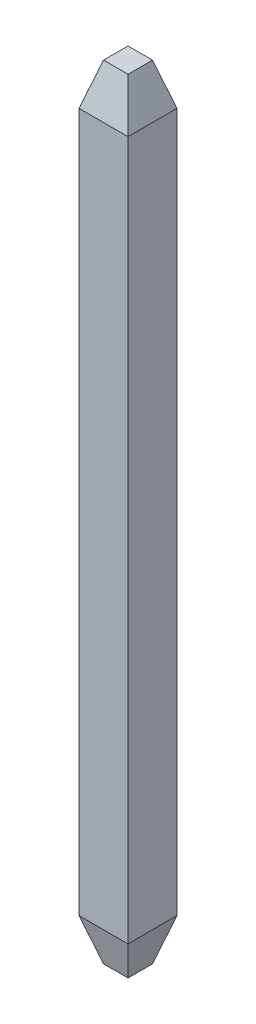
ISO-10303-21;
HEADER;
FILE_DESCRIPTION(('STEP AP214'),'2;1');
FILE_NAME('part.step','',(''),(''),'','','');
FILE_SCHEMA(('AUTOMOTIVE_DESIGN { 1 0 10303 214 1 1 1 1 }'));
ENDSEC;
DATA;
#1=APPLICATION_CONTEXT('core data for automotive mechanical design processes');
#2=APPLICATION_PROTOCOL_DEFINITION('international standard','automotive_design',2000,#1);
#3=PRODUCT_CONTEXT('',#1,'mechanical');
#4=PRODUCT('Part','Part','',(#3));
#5=PRODUCT_RELATED_PRODUCT_CATEGORY('part','',(#4));
#6=PRODUCT_DEFINITION_FORMATION('','',#4);
#7=PRODUCT_DEFINITION_CONTEXT('part definition',#1,'design');
#8=PRODUCT_DEFINITION('design','',#6,#7);
#9=PRODUCT_DEFINITION_SHAPE('','',#8);
#10=(LENGTH_UNIT() NAMED_UNIT(*) SI_UNIT(.MILLI.,.METRE.));
#11=(NAMED_UNIT(*) PLANE_ANGLE_UNIT() SI_UNIT($,.RADIAN.));
#12=(NAMED_UNIT(*) SI_UNIT($,.STERADIAN.) SOLID_ANGLE_UNIT());
#13=UNCERTAINTY_MEASURE_WITH_UNIT(LENGTH_MEASURE(1.E-05),#10,'distance_accuracy_value','');
#14=(GEOMETRIC_REPRESENTATION_CONTEXT(3) GLOBAL_UNCERTAINTY_ASSIGNED_CONTEXT((#13)) GLOBAL_UNIT_ASSIGNED_CONTEXT((#10,
#11,#12)) REPRESENTATION_CONTEXT('',''));
#15=CARTESIAN_POINT('',(0.,0.,0.));
#16=DIRECTION('',(0.,0.,1.));
#17=DIRECTION('',(1.,0.,0.));
#18=AXIS2_PLACEMENT_3D('',#15,#16,#17);
#19=CARTESIAN_POINT('',(-26.829999999987,-10.1039999999833,-16.9799999999763));
#20=DIRECTION('',(-0.959644900900969,-0.281214622974642,0.));
#21=DIRECTION('',(-0.281214622974642,0.959644900900969,0.));
#22=AXIS2_PLACEMENT_3D('',#19,#20,#21);
#23=PLANE('',#22);
#24=DIRECTION('',(0.,0.,-1.));
#25=VECTOR('',#24,1.);
#26=CARTESIAN_POINT('',(-26.829999999987,-10.1039999999833,-16.6599999999763));
#27=LINE('',#26,#25);
#28=CARTESIAN_POINT('',(-26.829999999987,-10.1039999999833,-16.6599999999763));
#29=VERTEX_POINT('',#28);
#30=CARTESIAN_POINT('',(-26.829999999987,-10.1039999999833,-17.2999999999763));
#31=VERTEX_POINT('',#30);
#32=EDGE_CURVE('E11',#29,#31,#27,.T.);
#33=ORIENTED_EDGE('',*,*,#32,.T.);
#34=DIRECTION('',(0.270714017147726,-0.923811583516618,0.270714017147726));
#35=VECTOR('',#34,1.);
#36=CARTESIAN_POINT('',(-26.829999999987,-10.1039999999833,-17.2999999999763));
#37=LINE('',#36,#35);
#38=CARTESIAN_POINT('',(-26.669999999987,-10.6499999999833,-17.1399999999763));
#39=VERTEX_POINT('',#38);
#40=EDGE_CURVE('E27',#31,#39,#37,.T.);
#41=ORIENTED_EDGE('',*,*,#40,.T.);
#42=DIRECTION('',(0.,0.,-1.));
#43=VECTOR('',#42,1.);
#44=CARTESIAN_POINT('',(-26.669999999987,-10.6499999999833,-16.8199999999763));
#45=LINE('',#44,#43);
#46=CARTESIAN_POINT('',(-26.669999999987,-10.6499999999833,-16.8199999999763));
#47=VERTEX_POINT('',#46);
#48=EDGE_CURVE('E53',#47,#39,#45,.T.);
#49=ORIENTED_EDGE('',*,*,#48,.F.);
#50=DIRECTION('',(0.270714017147726,-0.923811583516618,-0.270714017147726));
#51=VECTOR('',#50,1.);
#52=CARTESIAN_POINT('',(-26.829999999987,-10.1039999999833,-16.6599999999763));
#53=LINE('',#52,#51);
#54=EDGE_CURVE('E133',#29,#47,#53,.T.);
#55=ORIENTED_EDGE('',*,*,#54,.F.);
#56=EDGE_LOOP('',(#33,#41,#49,#55));
#57=FACE_BOUND('',#56,.T.);
#58=ADVANCED_FACE('F17',(#57),#23,.T.);
#59=CARTESIAN_POINT('',(-26.829999999987,-5.53543505344803,-16.6589999999763));
#60=DIRECTION('',(-1.,0.,0.));
#61=DIRECTION('',(0.,0.,1.));
#62=AXIS2_PLACEMENT_3D('',#59,#60,#61);
#63=PLANE('',#62);
#64=DIRECTION('',(0.,1.,0.));
#65=VECTOR('',#64,1.);
#66=CARTESIAN_POINT('',(-26.829999999987,-10.1039999999833,-17.2999999999763));
#67=LINE('',#66,#65);
#68=CARTESIAN_POINT('',(-26.829999999987,-0.965870106912755,-17.2999999999763));
#69=VERTEX_POINT('',#68);
#70=EDGE_CURVE('E40',#31,#69,#67,.T.);
#71=ORIENTED_EDGE('',*,*,#70,.F.);
#72=ORIENTED_EDGE('',*,*,#32,.F.);
#73=DIRECTION('',(0.,1.,0.));
#74=VECTOR('',#73,1.);
#75=CARTESIAN_POINT('',(-26.829999999987,-10.1039999999833,-16.6599999999763));
#76=LINE('',#75,#74);
#77=CARTESIAN_POINT('',(-26.829999999987,-0.965870106912755,-16.6599999999763));
#78=VERTEX_POINT('',#77);
#79=EDGE_CURVE('E151',#29,#78,#76,.T.);
#80=ORIENTED_EDGE('',*,*,#79,.T.);
#81=DIRECTION('',(0.,0.,-1.));
#82=VECTOR('',#81,1.);
#83=CARTESIAN_POINT('',(-26.829999999987,-0.965870106912753,-16.6599999999763));
#84=LINE('',#83,#82);
#85=EDGE_CURVE('E148',#78,#69,#84,.T.);
#86=ORIENTED_EDGE('',*,*,#85,.T.);
#87=EDGE_LOOP('',(#71,#72,#80,#86));
#88=FACE_BOUND('',#87,.T.);
#89=ADVANCED_FACE('F232',(#88),#63,.T.);
#90=CARTESIAN_POINT('',(-26.188999999987,-5.53443505344803,-17.2999999999763));
#91=DIRECTION('',(0.,0.,-1.));
#92=DIRECTION('',(0.,-1.,0.));
#93=AXIS2_PLACEMENT_3D('',#90,#91,#92);
#94=PLANE('',#93);
#95=DIRECTION('',(0.,1.,0.));
#96=VECTOR('',#95,1.);
#97=CARTESIAN_POINT('',(-26.189999999987,-10.1039999999833,-17.2999999999763));
#98=LINE('',#97,#96);
#99=CARTESIAN_POINT('',(-26.189999999987,-10.1039999999833,-17.2999999999763));
#100=VERTEX_POINT('',#99);
#101=CARTESIAN_POINT('',(-26.189999999987,-0.965870106912755,-17.2999999999763));
#102=VERTEX_POINT('',#101);
#103=EDGE_CURVE('E180',#100,#102,#98,.T.);
#104=ORIENTED_EDGE('',*,*,#103,.F.);
#105=DIRECTION('',(1.,0.,0.));
#106=VECTOR('',#105,1.);
#107=CARTESIAN_POINT('',(-26.829999999987,-10.1039999999833,-17.2999999999763));
#108=LINE('',#107,#106);
#109=EDGE_CURVE('E123',#31,#100,#108,.T.);
#110=ORIENTED_EDGE('',*,*,#109,.F.);
#111=ORIENTED_EDGE('',*,*,#70,.T.);
#112=DIRECTION('',(1.,0.,0.));
#113=VECTOR('',#112,1.);
#114=CARTESIAN_POINT('',(-26.829999999987,-0.965870106912753,-17.2999999999763));
#115=LINE('',#114,#113);
#116=EDGE_CURVE('E161',#69,#102,#115,.T.);
#117=ORIENTED_EDGE('',*,*,#116,.T.);
#118=EDGE_LOOP('',(#104,#110,#111,#117));
#119=FACE_BOUND('',#118,.T.);
#120=ADVANCED_FACE('F231',(#119),#94,.T.);
#121=CARTESIAN_POINT('',(-26.189999999987,-11.0738701069128,-16.9799999999763));
#122=DIRECTION('',(1.,0.,0.));
#123=DIRECTION('',(0.,1.,0.));
#124=AXIS2_PLACEMENT_3D('',#121,#122,#123);
#125=PLANE('',#124);
#126=DIRECTION('',(0.,1.,0.));
#127=VECTOR('',#126,1.);
#128=CARTESIAN_POINT('',(-26.189999999987,-10.1039999999833,-16.6599999999763));
#129=LINE('',#128,#127);
#130=CARTESIAN_POINT('',(-26.189999999987,-10.1039999999833,-16.6599999999763));
#131=VERTEX_POINT('',#130);
#132=CARTESIAN_POINT('',(-26.189999999987,-0.965870106912755,-16.6599999999763));
#133=VERTEX_POINT('',#132);
#134=EDGE_CURVE('E97',#131,#133,#129,.T.);
#135=ORIENTED_EDGE('',*,*,#134,.F.);
#136=DIRECTION('',(0.,0.,1.));
#137=VECTOR('',#136,1.);
#138=CARTESIAN_POINT('',(-26.189999999987,-10.1039999999833,-17.2999999999763));
#139=LINE('',#138,#137);
#140=EDGE_CURVE('E212',#100,#131,#139,.T.);
#141=ORIENTED_EDGE('',*,*,#140,.F.);
#142=ORIENTED_EDGE('',*,*,#103,.T.);
#143=DIRECTION('',(0.,0.,1.));
#144=VECTOR('',#143,1.);
#145=CARTESIAN_POINT('',(-26.189999999987,-0.965870106912753,-17.2999999999763));
#146=LINE('',#145,#144);
#147=EDGE_CURVE('E82',#102,#133,#146,.T.);
#148=ORIENTED_EDGE('',*,*,#147,.T.);
#149=EDGE_LOOP('',(#135,#141,#142,#148));
#150=FACE_BOUND('',#149,.T.);
#151=ADVANCED_FACE('F237',(#150),#125,.T.);
#152=CARTESIAN_POINT('',(-26.189999999987,-0.965870106912753,-16.9799999999763));
#153=DIRECTION('',(0.959644900900968,0.281214622974644,0.));
#154=DIRECTION('',(0.,0.,-1.));
#155=AXIS2_PLACEMENT_3D('',#152,#153,#154);
#156=PLANE('',#155);
#157=DIRECTION('',(-0.270714017147727,0.923811583516617,0.270714017147727));
#158=VECTOR('',#157,1.);
#159=CARTESIAN_POINT('',(-26.189999999987,-0.965870106912753,-17.2999999999763));
#160=LINE('',#159,#158);
#161=CARTESIAN_POINT('',(-26.349999999987,-0.419870106912756,-17.1399999999763));
#162=VERTEX_POINT('',#161);
#163=EDGE_CURVE('E155',#102,#162,#160,.T.);
#164=ORIENTED_EDGE('',*,*,#163,.T.);
#165=DIRECTION('',(0.,0.,1.));
#166=VECTOR('',#165,1.);
#167=CARTESIAN_POINT('',(-26.349999999987,-0.419870106912754,-17.1399999999763));
#168=LINE('',#167,#166);
#169=CARTESIAN_POINT('',(-26.349999999987,-0.419870106912756,-16.8199999999763));
#170=VERTEX_POINT('',#169);
#171=EDGE_CURVE('E158',#162,#170,#168,.T.);
#172=ORIENTED_EDGE('',*,*,#171,.T.);
#173=DIRECTION('',(-0.270714017147727,0.923811583516617,-0.270714017147727));
#174=VECTOR('',#173,1.);
#175=CARTESIAN_POINT('',(-26.189999999987,-0.965870106912753,-16.6599999999763));
#176=LINE('',#175,#174);
#177=EDGE_CURVE('E169',#133,#170,#176,.T.);
#178=ORIENTED_EDGE('',*,*,#177,.F.);
#179=ORIENTED_EDGE('',*,*,#147,.F.);
#180=EDGE_LOOP('',(#164,#172,#178,#179));
#181=FACE_BOUND('',#180,.T.);
#182=ADVANCED_FACE('F236',(#181),#156,.T.);
#183=CARTESIAN_POINT('',(-26.509999999987,-0.965870106912753,-16.6599999999763));
#184=DIRECTION('',(0.,0.281214622974644,0.959644900900968));
#185=DIRECTION('',(1.,0.,0.));
#186=AXIS2_PLACEMENT_3D('',#183,#184,#185);
#187=PLANE('',#186);
#188=ORIENTED_EDGE('',*,*,#177,.T.);
#189=DIRECTION('',(-1.,0.,0.));
#190=VECTOR('',#189,1.);
#191=CARTESIAN_POINT('',(-26.349999999987,-0.419870106912754,-16.8199999999763));
#192=LINE('',#191,#190);
#193=CARTESIAN_POINT('',(-26.669999999987,-0.419870106912756,-16.8199999999763));
#194=VERTEX_POINT('',#193);
#195=EDGE_CURVE('E208',#170,#194,#192,.T.);
#196=ORIENTED_EDGE('',*,*,#195,.T.);
#197=DIRECTION('',(0.270714017147727,0.923811583516617,-0.270714017147727));
#198=VECTOR('',#197,1.);
#199=CARTESIAN_POINT('',(-26.829999999987,-0.965870106912753,-16.6599999999763));
#200=LINE('',#199,#198);
#201=EDGE_CURVE('E175',#78,#194,#200,.T.);
#202=ORIENTED_EDGE('',*,*,#201,.F.);
#203=DIRECTION('',(-1.,0.,0.));
#204=VECTOR('',#203,1.);
#205=CARTESIAN_POINT('',(-26.189999999987,-0.965870106912753,-16.6599999999763));
#206=LINE('',#205,#204);
#207=EDGE_CURVE('E165',#133,#78,#206,.T.);
#208=ORIENTED_EDGE('',*,*,#207,.F.);
#209=EDGE_LOOP('',(#188,#196,#202,#208));
#210=FACE_BOUND('',#209,.T.);
#211=ADVANCED_FACE('F220',(#210),#187,.T.);
#212=CARTESIAN_POINT('',(-26.509999999987,-0.419870106912754,-17.1409999999763));
#213=DIRECTION('',(0.,1.,0.));
#214=DIRECTION('',(1.,0.,0.));
#215=AXIS2_PLACEMENT_3D('',#212,#213,#214);
#216=PLANE('',#215);
#217=DIRECTION('',(1.,0.,0.));
#218=VECTOR('',#217,1.);
#219=CARTESIAN_POINT('',(-26.669999999987,-0.419870106912754,-17.1399999999763));
#220=LINE('',#219,#218);
#221=CARTESIAN_POINT('',(-26.669999999987,-0.419870106912756,-17.1399999999763));
#222=VERTEX_POINT('',#221);
#223=EDGE_CURVE('E187',#222,#162,#220,.T.);
#224=ORIENTED_EDGE('',*,*,#223,.F.);
#225=DIRECTION('',(0.,0.,-1.));
#226=VECTOR('',#225,1.);
#227=CARTESIAN_POINT('',(-26.669999999987,-0.419870106912754,-16.8199999999763));
#228=LINE('',#227,#226);
#229=EDGE_CURVE('E164',#194,#222,#228,.T.);
#230=ORIENTED_EDGE('',*,*,#229,.F.);
#231=ORIENTED_EDGE('',*,*,#195,.F.);
#232=ORIENTED_EDGE('',*,*,#171,.F.);
#233=EDGE_LOOP('',(#224,#230,#231,#232));
#234=FACE_BOUND('',#233,.T.);
#235=ADVANCED_FACE('F223',(#234),#216,.T.);
#236=CARTESIAN_POINT('',(-26.189999999987,-10.1039999999833,-16.9799999999763));
#237=DIRECTION('',(0.959644900900969,-0.281214622974642,0.));
#238=DIRECTION('',(0.,0.,-1.));
#239=AXIS2_PLACEMENT_3D('',#236,#237,#238);
#240=PLANE('',#239);
#241=ORIENTED_EDGE('',*,*,#140,.T.);
#242=DIRECTION('',(-0.270714017147726,-0.923811583516618,-0.270714017147726));
#243=VECTOR('',#242,1.);
#244=CARTESIAN_POINT('',(-26.189999999987,-10.1039999999833,-16.6599999999763));
#245=LINE('',#244,#243);
#246=CARTESIAN_POINT('',(-26.349999999987,-10.6499999999833,-16.8199999999763));
#247=VERTEX_POINT('',#246);
#248=EDGE_CURVE('E21',#131,#247,#245,.T.);
#249=ORIENTED_EDGE('',*,*,#248,.T.);
#250=DIRECTION('',(0.,0.,1.));
#251=VECTOR('',#250,1.);
#252=CARTESIAN_POINT('',(-26.349999999987,-10.6499999999833,-17.1399999999763));
#253=LINE('',#252,#251);
#254=CARTESIAN_POINT('',(-26.349999999987,-10.6499999999833,-17.1399999999763));
#255=VERTEX_POINT('',#254);
#256=EDGE_CURVE('E129',#255,#247,#253,.T.);
#257=ORIENTED_EDGE('',*,*,#256,.F.);
#258=DIRECTION('',(-0.270714017147726,-0.923811583516618,0.270714017147726));
#259=VECTOR('',#258,1.);
#260=CARTESIAN_POINT('',(-26.189999999987,-10.1039999999833,-17.2999999999763));
#261=LINE('',#260,#259);
#262=EDGE_CURVE('E118',#100,#255,#261,.T.);
#263=ORIENTED_EDGE('',*,*,#262,.F.);
#264=EDGE_LOOP('',(#241,#249,#257,#263));
#265=FACE_BOUND('',#264,.T.);
#266=ADVANCED_FACE('F130',(#265),#240,.T.);
#267=CARTESIAN_POINT('',(-26.509999999987,-0.965870106912753,-17.2999999999763));
#268=DIRECTION('',(0.,0.281214622974644,-0.959644900900968));
#269=DIRECTION('',(-1.,0.,0.));
#270=AXIS2_PLACEMENT_3D('',#267,#268,#269);
#271=PLANE('',#270);
#272=DIRECTION('',(0.270714017147727,0.923811583516617,0.270714017147727));
#273=VECTOR('',#272,1.);
#274=CARTESIAN_POINT('',(-26.829999999987,-0.965870106912753,-17.2999999999763));
#275=LINE('',#274,#273);
#276=EDGE_CURVE('E184',#69,#222,#275,.T.);
#277=ORIENTED_EDGE('',*,*,#276,.T.);
#278=ORIENTED_EDGE('',*,*,#223,.T.);
#279=ORIENTED_EDGE('',*,*,#163,.F.);
#280=ORIENTED_EDGE('',*,*,#116,.F.);
#281=EDGE_LOOP('',(#277,#278,#279,#280));
#282=FACE_BOUND('',#281,.T.);
#283=ADVANCED_FACE('F228',(#282),#271,.T.);
#284=CARTESIAN_POINT('',(-26.829999999987,-0.965870106912753,-16.9799999999763));
#285=DIRECTION('',(-0.959644900900968,0.281214622974644,0.));
#286=DIRECTION('',(0.,0.,1.));
#287=AXIS2_PLACEMENT_3D('',#284,#285,#286);
#288=PLANE('',#287);
#289=ORIENTED_EDGE('',*,*,#201,.T.);
#290=ORIENTED_EDGE('',*,*,#229,.T.);
#291=ORIENTED_EDGE('',*,*,#276,.F.);
#292=ORIENTED_EDGE('',*,*,#85,.F.);
#293=EDGE_LOOP('',(#289,#290,#291,#292));
#294=FACE_BOUND('',#293,.T.);
#295=ADVANCED_FACE('F225',(#294),#288,.T.);
#296=CARTESIAN_POINT('',(-26.830999999987,-5.53543505344803,-16.6599999999763));
#297=DIRECTION('',(0.,0.,1.));
#298=DIRECTION('',(1.,0.,0.));
#299=AXIS2_PLACEMENT_3D('',#296,#297,#298);
#300=PLANE('',#299);
#301=ORIENTED_EDGE('',*,*,#79,.F.);
#302=DIRECTION('',(-1.,0.,0.));
#303=VECTOR('',#302,1.);
#304=CARTESIAN_POINT('',(-26.189999999987,-10.1039999999833,-16.6599999999763));
#305=LINE('',#304,#303);
#306=EDGE_CURVE('E172',#131,#29,#305,.T.);
#307=ORIENTED_EDGE('',*,*,#306,.F.);
#308=ORIENTED_EDGE('',*,*,#134,.T.);
#309=ORIENTED_EDGE('',*,*,#207,.T.);
#310=EDGE_LOOP('',(#301,#307,#308,#309));
#311=FACE_BOUND('',#310,.T.);
#312=ADVANCED_FACE('F19',(#311),#300,.T.);
#313=CARTESIAN_POINT('',(-26.509999999987,-10.1039999999833,-16.6599999999763));
#314=DIRECTION('',(0.,-0.281214622974642,0.959644900900969));
#315=DIRECTION('',(-1.,0.,0.));
#316=AXIS2_PLACEMENT_3D('',#313,#314,#315);
#317=PLANE('',#316);
#318=ORIENTED_EDGE('',*,*,#306,.T.);
#319=ORIENTED_EDGE('',*,*,#54,.T.);
#320=DIRECTION('',(-1.,0.,0.));
#321=VECTOR('',#320,1.);
#322=CARTESIAN_POINT('',(-26.349999999987,-10.6499999999833,-16.8199999999763));
#323=LINE('',#322,#321);
#324=EDGE_CURVE('E134',#247,#47,#323,.T.);
#325=ORIENTED_EDGE('',*,*,#324,.F.);
#326=ORIENTED_EDGE('',*,*,#248,.F.);
#327=EDGE_LOOP('',(#318,#319,#325,#326));
#328=FACE_BOUND('',#327,.T.);
#329=ADVANCED_FACE('F248',(#328),#317,.T.);
#330=CARTESIAN_POINT('',(-26.670999999987,-10.6499999999833,-16.9799999999763));
#331=DIRECTION('',(0.,-1.,0.));
#332=DIRECTION('',(0.,0.,-1.));
#333=AXIS2_PLACEMENT_3D('',#330,#331,#332);
#334=PLANE('',#333);
#335=ORIENTED_EDGE('',*,*,#256,.T.);
#336=ORIENTED_EDGE('',*,*,#324,.T.);
#337=ORIENTED_EDGE('',*,*,#48,.T.);
#338=DIRECTION('',(1.,0.,0.));
#339=VECTOR('',#338,1.);
#340=CARTESIAN_POINT('',(-26.669999999987,-10.6499999999833,-17.1399999999763));
#341=LINE('',#340,#339);
#342=EDGE_CURVE('E121',#39,#255,#341,.T.);
#343=ORIENTED_EDGE('',*,*,#342,.T.);
#344=EDGE_LOOP('',(#335,#336,#337,#343));
#345=FACE_BOUND('',#344,.T.);
#346=ADVANCED_FACE('F136',(#345),#334,.T.);
#347=CARTESIAN_POINT('',(-26.509999999987,-10.1039999999833,-17.2999999999763));
#348=DIRECTION('',(0.,-0.281214622974642,-0.959644900900969));
#349=DIRECTION('',(0.,-0.959644900900969,0.281214622974642));
#350=AXIS2_PLACEMENT_3D('',#347,#348,#349);
#351=PLANE('',#350);
#352=ORIENTED_EDGE('',*,*,#109,.T.);
#353=ORIENTED_EDGE('',*,*,#262,.T.);
#354=ORIENTED_EDGE('',*,*,#342,.F.);
#355=ORIENTED_EDGE('',*,*,#40,.F.);
#356=EDGE_LOOP('',(#352,#353,#354,#355));
#357=FACE_BOUND('',#356,.T.);
#358=ADVANCED_FACE('F120',(#357),#351,.T.);
#359=CLOSED_SHELL('',(#58,#89,#120,#151,#182,#211,#235,#266,#283,#295,#312,#329,#346,#358));
#360=MANIFOLD_SOLID_BREP('B1',#359);
#361=ADVANCED_BREP_SHAPE_REPRESENTATION('',(#18,#360),#14);
#362=SHAPE_DEFINITION_REPRESENTATION(#9,#361);
ENDSEC;
END-ISO-10303-21;
